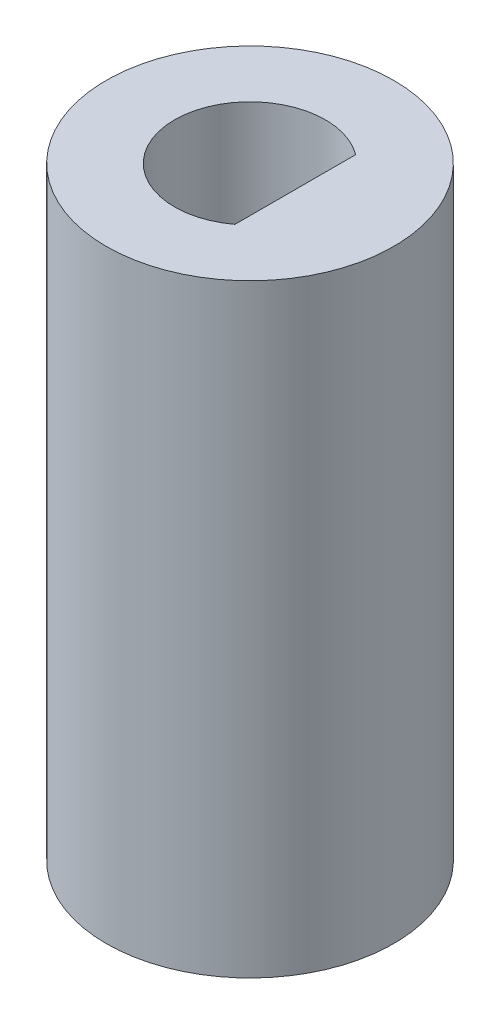
ISO-10303-21;
HEADER;
FILE_DESCRIPTION(('STEP AP214'),'2;1');
FILE_NAME('part.step','',(''),(''),'','','');
FILE_SCHEMA(('AUTOMOTIVE_DESIGN { 1 0 10303 214 1 1 1 1 }'));
ENDSEC;
DATA;
#1=APPLICATION_CONTEXT('core data for automotive mechanical design processes');
#2=APPLICATION_PROTOCOL_DEFINITION('international standard','automotive_design',2000,#1);
#3=PRODUCT_CONTEXT('',#1,'mechanical');
#4=PRODUCT('Part','Part','',(#3));
#5=PRODUCT_RELATED_PRODUCT_CATEGORY('part','',(#4));
#6=PRODUCT_DEFINITION_FORMATION('','',#4);
#7=PRODUCT_DEFINITION_CONTEXT('part definition',#1,'design');
#8=PRODUCT_DEFINITION('design','',#6,#7);
#9=PRODUCT_DEFINITION_SHAPE('','',#8);
#10=(LENGTH_UNIT() NAMED_UNIT(*) SI_UNIT(.MILLI.,.METRE.));
#11=(NAMED_UNIT(*) PLANE_ANGLE_UNIT() SI_UNIT($,.RADIAN.));
#12=(NAMED_UNIT(*) SI_UNIT($,.STERADIAN.) SOLID_ANGLE_UNIT());
#13=UNCERTAINTY_MEASURE_WITH_UNIT(LENGTH_MEASURE(1.E-05),#10,'distance_accuracy_value','');
#14=(GEOMETRIC_REPRESENTATION_CONTEXT(3) GLOBAL_UNCERTAINTY_ASSIGNED_CONTEXT((#13)) GLOBAL_UNIT_ASSIGNED_CONTEXT((#10,
#11,#12)) REPRESENTATION_CONTEXT('',''));
#15=CARTESIAN_POINT('',(0.,0.,0.));
#16=DIRECTION('',(0.,0.,1.));
#17=DIRECTION('',(1.,0.,0.));
#18=AXIS2_PLACEMENT_3D('',#15,#16,#17);
#19=CARTESIAN_POINT('',(0.,20.,0.));
#20=DIRECTION('',(0.,-1.,0.));
#21=DIRECTION('',(0.,0.,-1.));
#22=AXIS2_PLACEMENT_3D('',#19,#20,#21);
#23=CYLINDRICAL_SURFACE('',#22,4.7625);
#24=CARTESIAN_POINT('',(0.,20.,0.));
#25=DIRECTION('',(0.,1.,0.));
#26=DIRECTION('',(0.,0.,1.));
#27=AXIS2_PLACEMENT_3D('',#24,#25,#26);
#28=CIRCLE('',#27,4.7625);
#29=CARTESIAN_POINT('',(0.,20.,4.7625));
#30=VERTEX_POINT('',#29);
#31=EDGE_CURVE('E11',#30,#30,#28,.T.);
#32=ORIENTED_EDGE('',*,*,#31,.F.);
#33=EDGE_LOOP('',(#32));
#34=FACE_BOUND('',#33,.T.);
#35=CARTESIAN_POINT('',(0.,0.,0.));
#36=DIRECTION('',(0.,1.,0.));
#37=DIRECTION('',(0.,0.,1.));
#38=AXIS2_PLACEMENT_3D('',#35,#36,#37);
#39=CIRCLE('',#38,4.7625);
#40=CARTESIAN_POINT('',(0.,0.,4.7625));
#41=VERTEX_POINT('',#40);
#42=EDGE_CURVE('E42',#41,#41,#39,.T.);
#43=ORIENTED_EDGE('',*,*,#42,.T.);
#44=EDGE_LOOP('',(#43));
#45=FACE_BOUND('',#44,.T.);
#46=ADVANCED_FACE('F39',(#34,#45),#23,.T.);
#47=CARTESIAN_POINT('',(0.,20.,0.));
#48=DIRECTION('',(0.,1.,0.));
#49=DIRECTION('',(0.,0.,1.));
#50=AXIS2_PLACEMENT_3D('',#47,#48,#49);
#51=PLANE('',#50);
#52=CARTESIAN_POINT('',(0.,20.,0.));
#53=DIRECTION('',(0.,1.,0.));
#54=DIRECTION('',(0.,0.,1.));
#55=AXIS2_PLACEMENT_3D('',#52,#53,#54);
#56=CIRCLE('',#55,2.5);
#57=CARTESIAN_POINT('',(1.5,20.,-2.));
#58=VERTEX_POINT('',#57);
#59=CARTESIAN_POINT('',(1.5,20.,2.));
#60=VERTEX_POINT('',#59);
#61=EDGE_CURVE('E53',#58,#60,#56,.T.);
#62=ORIENTED_EDGE('',*,*,#61,.F.);
#63=DIRECTION('',(0.,0.,-1.));
#64=VECTOR('',#63,1.);
#65=CARTESIAN_POINT('',(1.5,20.,-2.));
#66=LINE('',#65,#64);
#67=EDGE_CURVE('E72',#60,#58,#66,.T.);
#68=ORIENTED_EDGE('',*,*,#67,.F.);
#69=EDGE_LOOP('',(#62,#68));
#70=FACE_BOUND('',#69,.T.);
#71=ORIENTED_EDGE('',*,*,#31,.T.);
#72=EDGE_LOOP('',(#71));
#73=FACE_BOUND('',#72,.T.);
#74=ADVANCED_FACE('F76',(#70,#73),#51,.T.);
#75=CARTESIAN_POINT('',(0.,0.,0.));
#76=DIRECTION('',(0.,1.,0.));
#77=DIRECTION('',(0.,0.,1.));
#78=AXIS2_PLACEMENT_3D('',#75,#76,#77);
#79=PLANE('',#78);
#80=CARTESIAN_POINT('',(0.,0.,0.));
#81=DIRECTION('',(0.,-1.,0.));
#82=DIRECTION('',(0.,0.,-1.));
#83=AXIS2_PLACEMENT_3D('',#80,#81,#82);
#84=CIRCLE('',#83,1.5875);
#85=CARTESIAN_POINT('',(0.,0.,-1.5875));
#86=VERTEX_POINT('',#85);
#87=EDGE_CURVE('E81',#86,#86,#84,.T.);
#88=ORIENTED_EDGE('',*,*,#87,.F.);
#89=EDGE_LOOP('',(#88));
#90=FACE_BOUND('',#89,.T.);
#91=ORIENTED_EDGE('',*,*,#42,.F.);
#92=EDGE_LOOP('',(#91));
#93=FACE_BOUND('',#92,.T.);
#94=ADVANCED_FACE('F94',(#90,#93),#79,.F.);
#95=CARTESIAN_POINT('',(0.,13.,0.));
#96=DIRECTION('',(0.,1.,0.));
#97=DIRECTION('',(0.,0.,1.));
#98=AXIS2_PLACEMENT_3D('',#95,#96,#97);
#99=CYLINDRICAL_SURFACE('',#98,2.5);
#100=ORIENTED_EDGE('',*,*,#61,.T.);
#101=DIRECTION('',(0.,1.,0.));
#102=VECTOR('',#101,1.);
#103=CARTESIAN_POINT('',(1.5,13.,2.));
#104=LINE('',#103,#102);
#105=CARTESIAN_POINT('',(1.5,13.,2.));
#106=VERTEX_POINT('',#105);
#107=EDGE_CURVE('E69',#106,#60,#104,.T.);
#108=ORIENTED_EDGE('',*,*,#107,.F.);
#109=CARTESIAN_POINT('',(0.,13.,0.));
#110=DIRECTION('',(0.,1.,0.));
#111=DIRECTION('',(0.,0.,1.));
#112=AXIS2_PLACEMENT_3D('',#109,#110,#111);
#113=CIRCLE('',#112,2.5);
#114=CARTESIAN_POINT('',(1.5,13.,-2.));
#115=VERTEX_POINT('',#114);
#116=EDGE_CURVE('E67',#115,#106,#113,.T.);
#117=ORIENTED_EDGE('',*,*,#116,.F.);
#118=DIRECTION('',(0.,1.,0.));
#119=VECTOR('',#118,1.);
#120=CARTESIAN_POINT('',(1.5,13.,-2.));
#121=LINE('',#120,#119);
#122=EDGE_CURVE('E61',#115,#58,#121,.T.);
#123=ORIENTED_EDGE('',*,*,#122,.T.);
#124=EDGE_LOOP('',(#100,#108,#117,#123));
#125=FACE_BOUND('',#124,.T.);
#126=ADVANCED_FACE('F65',(#125),#99,.F.);
#127=CARTESIAN_POINT('',(1.5,13.,-2.));
#128=DIRECTION('',(1.,0.,0.));
#129=DIRECTION('',(0.,0.,-1.));
#130=AXIS2_PLACEMENT_3D('',#127,#128,#129);
#131=PLANE('',#130);
#132=ORIENTED_EDGE('',*,*,#67,.T.);
#133=ORIENTED_EDGE('',*,*,#122,.F.);
#134=DIRECTION('',(0.,0.,-1.));
#135=VECTOR('',#134,1.);
#136=CARTESIAN_POINT('',(1.5,13.,-2.));
#137=LINE('',#136,#135);
#138=EDGE_CURVE('E84',#106,#115,#137,.T.);
#139=ORIENTED_EDGE('',*,*,#138,.F.);
#140=ORIENTED_EDGE('',*,*,#107,.T.);
#141=EDGE_LOOP('',(#132,#133,#139,#140));
#142=FACE_BOUND('',#141,.T.);
#143=ADVANCED_FACE('F73',(#142),#131,.F.);
#144=CARTESIAN_POINT('',(0.,13.,0.));
#145=DIRECTION('',(0.,1.,0.));
#146=DIRECTION('',(0.,0.,1.));
#147=AXIS2_PLACEMENT_3D('',#144,#145,#146);
#148=PLANE('',#147);
#149=ORIENTED_EDGE('',*,*,#116,.T.);
#150=ORIENTED_EDGE('',*,*,#138,.T.);
#151=EDGE_LOOP('',(#149,#150));
#152=FACE_BOUND('',#151,.T.);
#153=ADVANCED_FACE('F114',(#152),#148,.T.);
#154=CARTESIAN_POINT('',(0.,11.,0.));
#155=DIRECTION('',(0.,-1.,0.));
#156=DIRECTION('',(0.,0.,-1.));
#157=AXIS2_PLACEMENT_3D('',#154,#155,#156);
#158=CYLINDRICAL_SURFACE('',#157,1.5875);
#159=CARTESIAN_POINT('',(0.,11.,0.));
#160=DIRECTION('',(0.,-1.,0.));
#161=DIRECTION('',(0.,0.,-1.));
#162=AXIS2_PLACEMENT_3D('',#159,#160,#161);
#163=CIRCLE('',#162,1.5875);
#164=CARTESIAN_POINT('',(0.,11.,-1.5875));
#165=VERTEX_POINT('',#164);
#166=EDGE_CURVE('E78',#165,#165,#163,.T.);
#167=ORIENTED_EDGE('',*,*,#166,.F.);
#168=EDGE_LOOP('',(#167));
#169=FACE_BOUND('',#168,.T.);
#170=ORIENTED_EDGE('',*,*,#87,.T.);
#171=EDGE_LOOP('',(#170));
#172=FACE_BOUND('',#171,.T.);
#173=ADVANCED_FACE('F92',(#169,#172),#158,.F.);
#174=CARTESIAN_POINT('',(0.,11.,0.));
#175=DIRECTION('',(0.,-1.,0.));
#176=DIRECTION('',(0.,0.,-1.));
#177=AXIS2_PLACEMENT_3D('',#174,#175,#176);
#178=PLANE('',#177);
#179=ORIENTED_EDGE('',*,*,#166,.T.);
#180=EDGE_LOOP('',(#179));
#181=FACE_BOUND('',#180,.T.);
#182=ADVANCED_FACE('F119',(#181),#178,.T.);
#183=CLOSED_SHELL('',(#46,#74,#94,#126,#143,#153,#173,#182));
#184=MANIFOLD_SOLID_BREP('B2',#183);
#185=ADVANCED_BREP_SHAPE_REPRESENTATION('',(#18,#184),#14);
#186=SHAPE_DEFINITION_REPRESENTATION(#9,#185);
ENDSEC;
END-ISO-10303-21;
